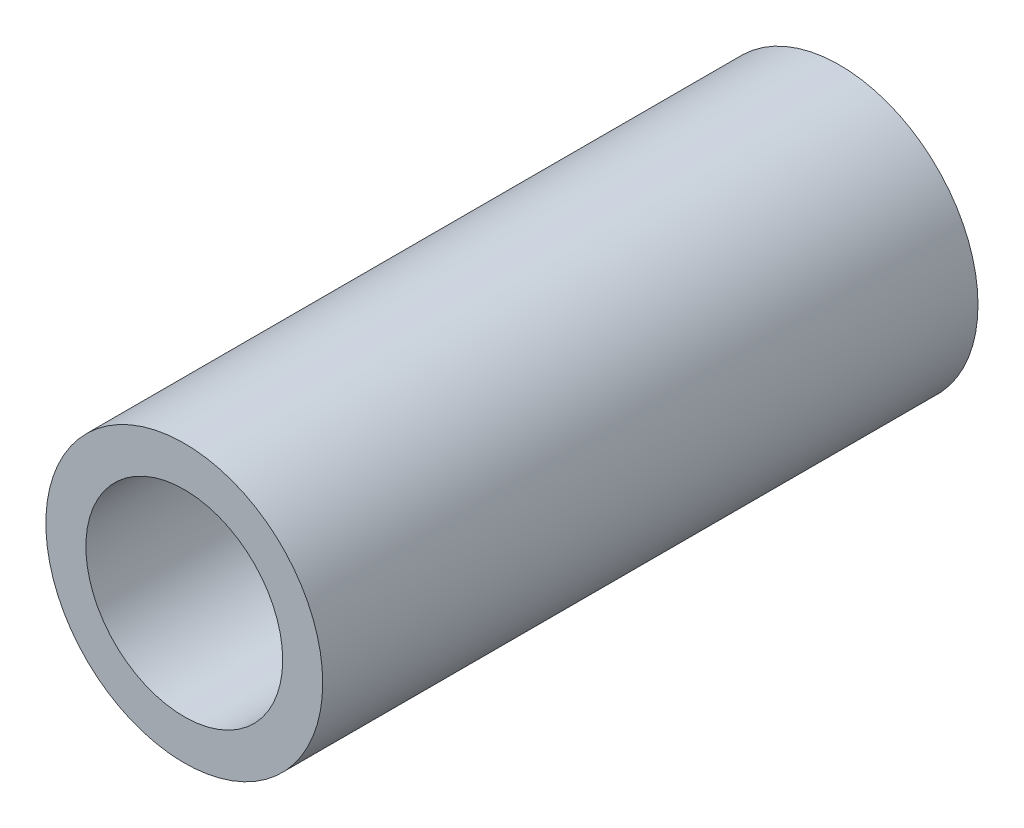
ISO-10303-21;
HEADER;
FILE_DESCRIPTION(('STEP AP214'),'2;1');
FILE_NAME('part.step','',(''),(''),'','','');
FILE_SCHEMA(('AUTOMOTIVE_DESIGN { 1 0 10303 214 1 1 1 1 }'));
ENDSEC;
DATA;
#1=APPLICATION_CONTEXT('core data for automotive mechanical design processes');
#2=APPLICATION_PROTOCOL_DEFINITION('international standard','automotive_design',2000,#1);
#3=PRODUCT_CONTEXT('',#1,'mechanical');
#4=PRODUCT('Part','Part','',(#3));
#5=PRODUCT_RELATED_PRODUCT_CATEGORY('part','',(#4));
#6=PRODUCT_DEFINITION_FORMATION('','',#4);
#7=PRODUCT_DEFINITION_CONTEXT('part definition',#1,'design');
#8=PRODUCT_DEFINITION('design','',#6,#7);
#9=PRODUCT_DEFINITION_SHAPE('','',#8);
#10=(LENGTH_UNIT() NAMED_UNIT(*) SI_UNIT(.MILLI.,.METRE.));
#11=(NAMED_UNIT(*) PLANE_ANGLE_UNIT() SI_UNIT($,.RADIAN.));
#12=(NAMED_UNIT(*) SI_UNIT($,.STERADIAN.) SOLID_ANGLE_UNIT());
#13=UNCERTAINTY_MEASURE_WITH_UNIT(LENGTH_MEASURE(1.E-05),#10,'distance_accuracy_value','');
#14=(GEOMETRIC_REPRESENTATION_CONTEXT(3) GLOBAL_UNCERTAINTY_ASSIGNED_CONTEXT((#13)) GLOBAL_UNIT_ASSIGNED_CONTEXT((#10,
#11,#12)) REPRESENTATION_CONTEXT('',''));
#15=CARTESIAN_POINT('',(0.,0.,0.));
#16=DIRECTION('',(0.,0.,1.));
#17=DIRECTION('',(1.,0.,0.));
#18=AXIS2_PLACEMENT_3D('',#15,#16,#17);
#19=CARTESIAN_POINT('',(0.,0.,68.58));
#20=DIRECTION('',(0.,0.,1.));
#21=DIRECTION('',(1.,0.,0.));
#22=AXIS2_PLACEMENT_3D('',#19,#20,#21);
#23=PLANE('',#22);
#24=CARTESIAN_POINT('',(0.,0.,68.58));
#25=DIRECTION('',(0.,0.,1.));
#26=DIRECTION('',(1.,0.,0.));
#27=AXIS2_PLACEMENT_3D('',#24,#25,#26);
#28=CIRCLE('',#27,14.487499954);
#29=CARTESIAN_POINT('',(14.487499954,0.,68.58));
#30=VERTEX_POINT('',#29);
#31=EDGE_CURVE('E10',#30,#30,#28,.T.);
#32=ORIENTED_EDGE('',*,*,#31,.T.);
#33=EDGE_LOOP('',(#32));
#34=FACE_BOUND('',#33,.T.);
#35=CARTESIAN_POINT('',(0.,0.,68.58));
#36=DIRECTION('',(0.,0.,1.));
#37=DIRECTION('',(1.,0.,0.));
#38=AXIS2_PLACEMENT_3D('',#35,#36,#37);
#39=CIRCLE('',#38,10.299999974);
#40=CARTESIAN_POINT('',(10.299999974,0.,68.58));
#41=VERTEX_POINT('',#40);
#42=EDGE_CURVE('E48',#41,#41,#39,.T.);
#43=ORIENTED_EDGE('',*,*,#42,.F.);
#44=EDGE_LOOP('',(#43));
#45=FACE_BOUND('',#44,.T.);
#46=ADVANCED_FACE('F37',(#34,#45),#23,.T.);
#47=CARTESIAN_POINT('',(0.,0.,0.));
#48=DIRECTION('',(0.,0.,1.));
#49=DIRECTION('',(1.,0.,0.));
#50=AXIS2_PLACEMENT_3D('',#47,#48,#49);
#51=PLANE('',#50);
#52=CARTESIAN_POINT('',(0.,0.,0.));
#53=DIRECTION('',(0.,0.,1.));
#54=DIRECTION('',(1.,0.,0.));
#55=AXIS2_PLACEMENT_3D('',#52,#53,#54);
#56=CIRCLE('',#55,14.487499954);
#57=CARTESIAN_POINT('',(14.487499954,0.,0.));
#58=VERTEX_POINT('',#57);
#59=EDGE_CURVE('E41',#58,#58,#56,.T.);
#60=ORIENTED_EDGE('',*,*,#59,.F.);
#61=EDGE_LOOP('',(#60));
#62=FACE_BOUND('',#61,.T.);
#63=CARTESIAN_POINT('',(0.,0.,0.));
#64=DIRECTION('',(0.,0.,1.));
#65=DIRECTION('',(1.,0.,0.));
#66=AXIS2_PLACEMENT_3D('',#63,#64,#65);
#67=CIRCLE('',#66,10.299999974);
#68=CARTESIAN_POINT('',(10.299999974,0.,0.));
#69=VERTEX_POINT('',#68);
#70=EDGE_CURVE('E50',#69,#69,#67,.T.);
#71=ORIENTED_EDGE('',*,*,#70,.T.);
#72=EDGE_LOOP('',(#71));
#73=FACE_BOUND('',#72,.T.);
#74=ADVANCED_FACE('F60',(#62,#73),#51,.F.);
#75=CARTESIAN_POINT('',(0.,0.,68.58));
#76=DIRECTION('',(0.,0.,-1.));
#77=DIRECTION('',(-1.,0.,0.));
#78=AXIS2_PLACEMENT_3D('',#75,#76,#77);
#79=CYLINDRICAL_SURFACE('',#78,14.487499954);
#80=ORIENTED_EDGE('',*,*,#31,.F.);
#81=EDGE_LOOP('',(#80));
#82=FACE_BOUND('',#81,.T.);
#83=ORIENTED_EDGE('',*,*,#59,.T.);
#84=EDGE_LOOP('',(#83));
#85=FACE_BOUND('',#84,.T.);
#86=ADVANCED_FACE('F39',(#82,#85),#79,.T.);
#87=CARTESIAN_POINT('',(0.,0.,68.58));
#88=DIRECTION('',(0.,0.,-1.));
#89=DIRECTION('',(-1.,0.,0.));
#90=AXIS2_PLACEMENT_3D('',#87,#88,#89);
#91=CYLINDRICAL_SURFACE('',#90,10.299999974);
#92=ORIENTED_EDGE('',*,*,#42,.T.);
#93=EDGE_LOOP('',(#92));
#94=FACE_BOUND('',#93,.T.);
#95=ORIENTED_EDGE('',*,*,#70,.F.);
#96=EDGE_LOOP('',(#95));
#97=FACE_BOUND('',#96,.T.);
#98=ADVANCED_FACE('F56',(#94,#97),#91,.F.);
#99=CLOSED_SHELL('',(#46,#74,#86,#98));
#100=MANIFOLD_SOLID_BREP('B2',#99);
#101=ADVANCED_BREP_SHAPE_REPRESENTATION('',(#18,#100),#14);
#102=SHAPE_DEFINITION_REPRESENTATION(#9,#101);
ENDSEC;
END-ISO-10303-21;
